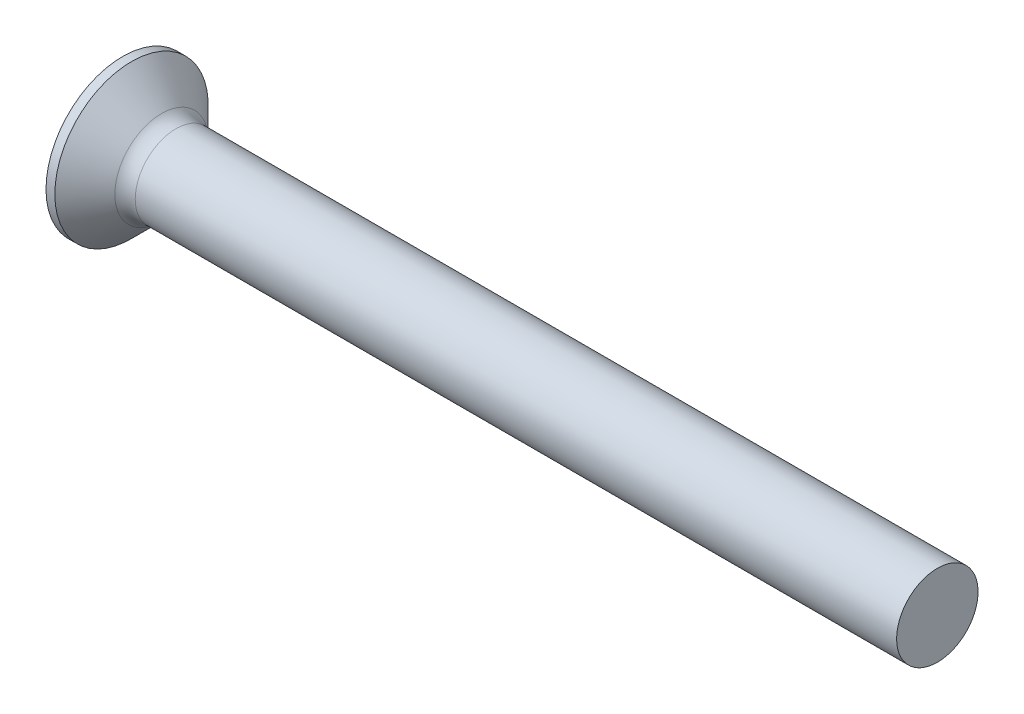
ISO-10303-21;
HEADER;
FILE_DESCRIPTION(('STEP AP214'),'2;1');
FILE_NAME('part.step','',(''),(''),'','','');
FILE_SCHEMA(('AUTOMOTIVE_DESIGN { 1 0 10303 214 1 1 1 1 }'));
ENDSEC;
DATA;
#1=APPLICATION_CONTEXT('core data for automotive mechanical design processes');
#2=APPLICATION_PROTOCOL_DEFINITION('international standard','automotive_design',2000,#1);
#3=PRODUCT_CONTEXT('',#1,'mechanical');
#4=PRODUCT('Part','Part','',(#3));
#5=PRODUCT_RELATED_PRODUCT_CATEGORY('part','',(#4));
#6=PRODUCT_DEFINITION_FORMATION('','',#4);
#7=PRODUCT_DEFINITION_CONTEXT('part definition',#1,'design');
#8=PRODUCT_DEFINITION('design','',#6,#7);
#9=PRODUCT_DEFINITION_SHAPE('','',#8);
#10=(LENGTH_UNIT() NAMED_UNIT(*) SI_UNIT(.MILLI.,.METRE.));
#11=(NAMED_UNIT(*) PLANE_ANGLE_UNIT() SI_UNIT($,.RADIAN.));
#12=(NAMED_UNIT(*) SI_UNIT($,.STERADIAN.) SOLID_ANGLE_UNIT());
#13=UNCERTAINTY_MEASURE_WITH_UNIT(LENGTH_MEASURE(1.E-05),#10,'distance_accuracy_value','');
#14=(GEOMETRIC_REPRESENTATION_CONTEXT(3) GLOBAL_UNCERTAINTY_ASSIGNED_CONTEXT((#13)) GLOBAL_UNIT_ASSIGNED_CONTEXT((#10,
#11,#12)) REPRESENTATION_CONTEXT('',''));
#15=CARTESIAN_POINT('',(0.,0.,0.));
#16=DIRECTION('',(0.,0.,1.));
#17=DIRECTION('',(1.,0.,0.));
#18=AXIS2_PLACEMENT_3D('',#15,#16,#17);
#19=CARTESIAN_POINT('',(12.1008928571429,0.,0.));
#20=DIRECTION('',(-1.,0.,0.));
#21=DIRECTION('',(0.,-1.,0.));
#22=AXIS2_PLACEMENT_3D('',#19,#20,#21);
#23=SPHERICAL_SURFACE('',#22,12.1008928571429);
#24=CARTESIAN_POINT('',(1.4,0.,0.));
#25=DIRECTION('',(-1.,0.,0.));
#26=DIRECTION('',(0.,0.,1.));
#27=AXIS2_PLACEMENT_3D('',#24,#25,#26);
#28=CIRCLE('',#27,5.65);
#29=CARTESIAN_POINT('',(1.4,0.,5.65));
#30=VERTEX_POINT('',#29);
#31=EDGE_CURVE('E204',#30,#30,#28,.T.);
#32=ORIENTED_EDGE('',*,*,#31,.T.);
#33=EDGE_LOOP('',(#32));
#34=FACE_BOUND('',#33,.T.);
#35=CARTESIAN_POINT('',(12.1008928571429,0.71,0.));
#36=DIRECTION('',(0.,-1.,0.));
#37=DIRECTION('',(0.,0.,-1.));
#38=AXIS2_PLACEMENT_3D('',#35,#36,#37);
#39=CIRCLE('',#38,12.0800458583588);
#40=CARTESIAN_POINT('',(0.482948472413199,0.710000000000012,-3.30921081428481));
#41=VERTEX_POINT('',#40);
#42=CARTESIAN_POINT('',(0.0987540062714724,0.710000000000005,-1.36973389549017));
#43=VERTEX_POINT('',#42);
#44=EDGE_CURVE('E284',#41,#43,#39,.F.);
#45=ORIENTED_EDGE('',*,*,#44,.T.);
#46=CARTESIAN_POINT('',(0.098754006271469,0.,0.));
#47=DIRECTION('',(1.,0.,0.));
#48=DIRECTION('',(0.,0.,-1.));
#49=AXIS2_PLACEMENT_3D('',#46,#47,#48);
#50=CIRCLE('',#49,1.54281267315727);
#51=CARTESIAN_POINT('',(0.098754006271469,1.36973389549016,-0.71));
#52=VERTEX_POINT('',#51);
#53=EDGE_CURVE('E313',#43,#52,#50,.T.);
#54=ORIENTED_EDGE('',*,*,#53,.T.);
#55=CARTESIAN_POINT('',(12.1008928571429,0.,-0.71));
#56=DIRECTION('',(0.,0.,1.));
#57=DIRECTION('',(1.,0.,0.));
#58=AXIS2_PLACEMENT_3D('',#55,#56,#57);
#59=CIRCLE('',#58,12.0800458583588);
#60=CARTESIAN_POINT('',(0.482948472413196,3.30921081428482,-0.71));
#61=VERTEX_POINT('',#60);
#62=EDGE_CURVE('E226',#52,#61,#59,.F.);
#63=ORIENTED_EDGE('',*,*,#62,.T.);
#64=CARTESIAN_POINT('',(11.1092745190887,-1.98887902775924,0.));
#65=DIRECTION('',(0.446197753347436,0.894934391398443,0.));
#66=DIRECTION('',(-0.894934391398443,0.446197753347436,0.));
#67=AXIS2_PLACEMENT_3D('',#64,#65,#66);
#68=CIRCLE('',#67,11.8950687776332);
#69=CARTESIAN_POINT('',(0.482948472413196,3.30921081428482,0.710000000000001));
#70=VERTEX_POINT('',#69);
#71=EDGE_CURVE('E230',#70,#61,#68,.F.);
#72=ORIENTED_EDGE('',*,*,#71,.F.);
#73=CARTESIAN_POINT('',(12.1008928571429,0.,0.71));
#74=DIRECTION('',(0.,0.,-1.));
#75=DIRECTION('',(0.,1.,0.));
#76=AXIS2_PLACEMENT_3D('',#73,#74,#75);
#77=CIRCLE('',#76,12.0800458583588);
#78=CARTESIAN_POINT('',(0.098754006271469,1.36973389549016,0.71));
#79=VERTEX_POINT('',#78);
#80=EDGE_CURVE('E223',#70,#79,#77,.F.);
#81=ORIENTED_EDGE('',*,*,#80,.T.);
#82=CARTESIAN_POINT('',(0.0987540062714738,0.709999999999995,1.36973389549018));
#83=VERTEX_POINT('',#82);
#84=EDGE_CURVE('E339',#79,#83,#50,.T.);
#85=ORIENTED_EDGE('',*,*,#84,.T.);
#86=CARTESIAN_POINT('',(0.482948472413196,0.709999999999988,3.30921081428482));
#87=VERTEX_POINT('',#86);
#88=EDGE_CURVE('E251',#83,#87,#39,.F.);
#89=ORIENTED_EDGE('',*,*,#88,.T.);
#90=CARTESIAN_POINT('',(11.1092745190887,0.,-1.98887902775924));
#91=DIRECTION('',(0.446197753347436,0.,0.894934391398443));
#92=DIRECTION('',(0.894934391398443,0.,-0.446197753347436));
#93=AXIS2_PLACEMENT_3D('',#90,#91,#92);
#94=CIRCLE('',#93,11.8950687776332);
#95=CARTESIAN_POINT('',(0.482948472413196,-0.710000000000012,3.30921081428481));
#96=VERTEX_POINT('',#95);
#97=EDGE_CURVE('E48',#96,#87,#94,.F.);
#98=ORIENTED_EDGE('',*,*,#97,.F.);
#99=CARTESIAN_POINT('',(12.1008928571429,-0.71,0.));
#100=DIRECTION('',(0.,1.,0.));
#101=DIRECTION('',(0.,0.,1.));
#102=AXIS2_PLACEMENT_3D('',#99,#100,#101);
#103=CIRCLE('',#102,12.0800458583588);
#104=CARTESIAN_POINT('',(0.0987540062714724,-0.710000000000005,1.36973389549017));
#105=VERTEX_POINT('',#104);
#106=EDGE_CURVE('E254',#96,#105,#103,.F.);
#107=ORIENTED_EDGE('',*,*,#106,.T.);
#108=CARTESIAN_POINT('',(0.098754006271469,-1.36973389549016,0.71));
#109=VERTEX_POINT('',#108);
#110=EDGE_CURVE('E370',#105,#109,#50,.T.);
#111=ORIENTED_EDGE('',*,*,#110,.T.);
#112=CARTESIAN_POINT('',(0.482948472413197,-3.30921081428481,0.71));
#113=VERTEX_POINT('',#112);
#114=EDGE_CURVE('E222',#109,#113,#77,.F.);
#115=ORIENTED_EDGE('',*,*,#114,.T.);
#116=CARTESIAN_POINT('',(11.1092745190887,1.98887902775924,0.));
#117=DIRECTION('',(0.446197753347436,-0.894934391398443,0.));
#118=DIRECTION('',(0.894934391398443,0.446197753347436,0.));
#119=AXIS2_PLACEMENT_3D('',#116,#117,#118);
#120=CIRCLE('',#119,11.8950687776332);
#121=CARTESIAN_POINT('',(0.482948472413197,-3.30921081428481,-0.71));
#122=VERTEX_POINT('',#121);
#123=EDGE_CURVE('E220',#122,#113,#120,.F.);
#124=ORIENTED_EDGE('',*,*,#123,.F.);
#125=CARTESIAN_POINT('',(0.098754006271469,-1.36973389549016,-0.71));
#126=VERTEX_POINT('',#125);
#127=EDGE_CURVE('E227',#122,#126,#59,.F.);
#128=ORIENTED_EDGE('',*,*,#127,.T.);
#129=CARTESIAN_POINT('',(0.0987540062714729,-0.709999999999995,-1.36973389549018));
#130=VERTEX_POINT('',#129);
#131=EDGE_CURVE('E334',#126,#130,#50,.T.);
#132=ORIENTED_EDGE('',*,*,#131,.T.);
#133=CARTESIAN_POINT('',(0.482948472413199,-0.709999999999988,-3.30921081428482));
#134=VERTEX_POINT('',#133);
#135=EDGE_CURVE('E256',#130,#134,#103,.F.);
#136=ORIENTED_EDGE('',*,*,#135,.T.);
#137=CARTESIAN_POINT('',(11.1092745190887,0.,1.98887902775924));
#138=DIRECTION('',(0.446197753347436,0.,-0.894934391398443));
#139=DIRECTION('',(-0.894934391398443,0.,-0.446197753347436));
#140=AXIS2_PLACEMENT_3D('',#137,#138,#139);
#141=CIRCLE('',#140,11.8950687776332);
#142=EDGE_CURVE('E233',#41,#134,#141,.F.);
#143=ORIENTED_EDGE('',*,*,#142,.F.);
#144=EDGE_LOOP('',(#45,#54,#63,#72,#81,#85,#89,#98,#107,#111,#115,#124,#128,#132,#136,#143));
#145=FACE_BOUND('',#144,.T.);
#146=ADVANCED_FACE('F35',(#34,#145),#23,.T.);
#147=CARTESIAN_POINT('',(3.85,1.63046113000165,-0.71));
#148=DIRECTION('',(0.,0.,1.));
#149=DIRECTION('',(1.,0.,0.));
#150=AXIS2_PLACEMENT_3D('',#147,#148,#149);
#151=PLANE('',#150);
#152=ORIENTED_EDGE('',*,*,#62,.F.);
#153=CARTESIAN_POINT('',(-2.28416404218902,1.55502211619796,-0.71));
#154=CARTESIAN_POINT('',(-1.81431723075455,1.5188973409894,-0.71));
#155=CARTESIAN_POINT('',(-1.34448576560339,1.48257035219444,-0.71));
#156=CARTESIAN_POINT('',(-0.404856630505598,1.40937585920065,-0.71));
#157=CARTESIAN_POINT('',(0.0649410386989113,1.37250834548094,-0.71));
#158=CARTESIAN_POINT('',(0.769597582006443,1.31670055934447,-0.71));
#159=CARTESIAN_POINT('',(1.00447650753016,1.29801353896655,-0.71));
#160=CARTESIAN_POINT('',(1.47421830081038,1.26044599841081,-0.71));
#161=CARTESIAN_POINT('',(1.70908116860549,1.24156547871592,-0.71));
#162=CARTESIAN_POINT('',(2.17878500370985,1.20358363137223,-0.71));
#163=CARTESIAN_POINT('',(2.41362597132576,1.18448230751803,-0.71));
#164=CARTESIAN_POINT('',(2.88328904378171,1.14602401545414,-0.71));
#165=CARTESIAN_POINT('',(3.11811114843923,1.12666704501482,-0.71));
#166=CARTESIAN_POINT('',(3.65621662823936,1.08196691887825,-0.71));
#167=CARTESIAN_POINT('',(3.95949176983097,1.05652447286241,-0.71));
#168=CARTESIAN_POINT('',(4.56598922959562,1.0050269975527,-0.71));
#169=CARTESIAN_POINT('',(4.86921154792195,0.978971970067306,-0.71));
#170=CARTESIAN_POINT('',(5.47557652075129,0.926088010649148,-0.71));
#171=CARTESIAN_POINT('',(5.77871917797252,0.899259109950115,-0.71));
#172=CARTESIAN_POINT('',(6.38491792808092,0.844594572548036,-0.71));
#173=CARTESIAN_POINT('',(6.68797401983324,0.816758923206859,-0.71));
#174=CARTESIAN_POINT('',(7.29401284533129,0.759724083482611,-0.71));
#175=CARTESIAN_POINT('',(7.59699555631377,0.730524650498859,-0.71));
#176=CARTESIAN_POINT('',(8.20276249162816,0.670213734528277,-0.71));
#177=CARTESIAN_POINT('',(8.50554672245943,0.639102317673413,-0.71));
#178=CARTESIAN_POINT('',(8.95951323858269,0.590224303525513,-0.71));
#179=CARTESIAN_POINT('',(9.11081400259868,0.573561556658641,-0.71));
#180=CARTESIAN_POINT('',(9.41330341679391,0.539268690497853,-0.71));
#181=CARTESIAN_POINT('',(9.5644920688636,0.521638587909618,-0.71));
#182=CARTESIAN_POINT('',(9.86673681243328,0.485109134793815,-0.71));
#183=CARTESIAN_POINT('',(10.017792885913,0.466209632690505,-0.71));
#184=CARTESIAN_POINT('',(10.3196626901993,0.426508363296112,-0.71));
#185=CARTESIAN_POINT('',(10.4704764059468,0.405706482121441,-0.71));
#186=CARTESIAN_POINT('',(10.6211140501562,0.383637037200752,-0.71));
#187=B_SPLINE_CURVE_WITH_KNOTS('',3,(#153,#154,#155,#156,#157,#158,#159,#160,#161,#162,#163,
#164,#165,#166,#167,#168,#169,#170,#171,#172,#173,#174,#175,#176,#177,#178,#179,#180,#181,#182,
#183,#184,#185,#186),.UNSPECIFIED.,.F.,.F.,(4,2,2,2,2,2,2,2,2,2,2,2,2,2,2,2,4),(0.,
1.41370082264972,2.82742657641579,3.53428988171118,4.24115142325821,4.94800083512325,
5.6548564158573,6.56787736296362,7.480895614993,8.39387706878533,9.30686998759161,
10.2200259400543,11.1331503259072,11.5897944565879,12.0464307037662,12.5031215739793,
12.9598398013493),.UNSPECIFIED.);
#188=CARTESIAN_POINT('',(3.85,1.06563607765503,-0.71));
#189=VERTEX_POINT('',#188);
#190=EDGE_CURVE('E359',#52,#189,#187,.T.);
#191=ORIENTED_EDGE('',*,*,#190,.T.);
#192=DIRECTION('',(0.,1.,0.));
#193=VECTOR('',#192,1.);
#194=CARTESIAN_POINT('',(3.85,-1.63046113000165,-0.71));
#195=LINE('',#194,#193);
#196=CARTESIAN_POINT('',(3.85,1.63046113000165,-0.71));
#197=VERTEX_POINT('',#196);
#198=EDGE_CURVE('E304',#189,#197,#195,.T.);
#199=ORIENTED_EDGE('',*,*,#198,.T.);
#200=DIRECTION('',(0.894934391398443,-0.446197753347436,0.));
#201=VECTOR('',#200,1.);
#202=CARTESIAN_POINT('',(0.,3.55,-0.71));
#203=LINE('',#202,#201);
#204=EDGE_CURVE('E201',#61,#197,#203,.T.);
#205=ORIENTED_EDGE('',*,*,#204,.F.);
#206=EDGE_LOOP('',(#152,#191,#199,#205));
#207=FACE_BOUND('',#206,.T.);
#208=ADVANCED_FACE('F169',(#207),#151,.T.);
#209=CARTESIAN_POINT('',(3.85,-1.63046113000165,-0.71));
#210=VERTEX_POINT('',#209);
#211=CARTESIAN_POINT('',(3.85,-1.06563607765503,-0.71));
#212=VERTEX_POINT('',#211);
#213=EDGE_CURVE('E210',#210,#212,#195,.T.);
#214=ORIENTED_EDGE('',*,*,#213,.T.);
#215=CARTESIAN_POINT('',(-2.28416404218902,-1.55502211619796,-0.71));
#216=CARTESIAN_POINT('',(-1.81431723075455,-1.5188973409894,-0.71));
#217=CARTESIAN_POINT('',(-1.34448576560339,-1.48257035219444,-0.71));
#218=CARTESIAN_POINT('',(-0.404856630505598,-1.40937585920065,-0.71));
#219=CARTESIAN_POINT('',(0.0649410386989112,-1.37250834548094,-0.71));
#220=CARTESIAN_POINT('',(0.769597582006443,-1.31670055934447,-0.71));
#221=CARTESIAN_POINT('',(1.00447650753016,-1.29801353896655,-0.71));
#222=CARTESIAN_POINT('',(1.47421830081038,-1.26044599841081,-0.71));
#223=CARTESIAN_POINT('',(1.70908116860549,-1.24156547871592,-0.71));
#224=CARTESIAN_POINT('',(2.17878500370985,-1.20358363137223,-0.71));
#225=CARTESIAN_POINT('',(2.41362597132576,-1.18448230751803,-0.71));
#226=CARTESIAN_POINT('',(2.88328904378171,-1.14602401545414,-0.71));
#227=CARTESIAN_POINT('',(3.11811114843923,-1.12666704501482,-0.71));
#228=CARTESIAN_POINT('',(3.65621662823936,-1.08196691887825,-0.71));
#229=CARTESIAN_POINT('',(3.95949176983097,-1.05652447286241,-0.71));
#230=CARTESIAN_POINT('',(4.56598922959562,-1.0050269975527,-0.71));
#231=CARTESIAN_POINT('',(4.86921154792195,-0.978971970067306,-0.71));
#232=CARTESIAN_POINT('',(5.47557652075129,-0.926088010649148,-0.71));
#233=CARTESIAN_POINT('',(5.77871917797252,-0.899259109950115,-0.71));
#234=CARTESIAN_POINT('',(6.38491792808092,-0.844594572548036,-0.71));
#235=CARTESIAN_POINT('',(6.68797401983324,-0.816758923206859,-0.71));
#236=CARTESIAN_POINT('',(7.2940128453313,-0.75972408348261,-0.71));
#237=CARTESIAN_POINT('',(7.59699555631378,-0.730524650498859,-0.71));
#238=CARTESIAN_POINT('',(8.20276249162817,-0.670213734528277,-0.71));
#239=CARTESIAN_POINT('',(8.50554672245944,-0.639102317673412,-0.71));
#240=CARTESIAN_POINT('',(8.9595132385827,-0.590224303525513,-0.71));
#241=CARTESIAN_POINT('',(9.11081400259869,-0.57356155665864,-0.71));
#242=CARTESIAN_POINT('',(9.41330341679392,-0.539268690497852,-0.71));
#243=CARTESIAN_POINT('',(9.5644920688636,-0.521638587909617,-0.71));
#244=CARTESIAN_POINT('',(9.86673681243329,-0.485109134793814,-0.71));
#245=CARTESIAN_POINT('',(10.017792885913,-0.466209632690504,-0.71));
#246=CARTESIAN_POINT('',(10.3196626901993,-0.426508363296111,-0.71));
#247=CARTESIAN_POINT('',(10.4704764059468,-0.40570648212144,-0.71));
#248=CARTESIAN_POINT('',(10.6211140501562,-0.383637037200751,-0.71));
#249=B_SPLINE_CURVE_WITH_KNOTS('',3,(#215,#216,#217,#218,#219,#220,#221,#222,#223,#224,#225,
#226,#227,#228,#229,#230,#231,#232,#233,#234,#235,#236,#237,#238,#239,#240,#241,#242,#243,#244,
#245,#246,#247,#248),.UNSPECIFIED.,.F.,.F.,(4,2,2,2,2,2,2,2,2,2,2,2,2,2,2,2,4),(0.,
1.41370082264972,2.82742657641579,3.53428988171118,4.24115142325821,4.94800083512325,
5.6548564158573,6.56787736296362,7.480895614993,8.39387706878533,9.30686998759161,
10.2200259400543,11.1331503259072,11.5897944565879,12.0464307037663,12.5031215739793,
12.9598398013493),.UNSPECIFIED.);
#250=EDGE_CURVE('E338',#212,#126,#249,.F.);
#251=ORIENTED_EDGE('',*,*,#250,.T.);
#252=ORIENTED_EDGE('',*,*,#127,.F.);
#253=DIRECTION('',(0.894934391398443,0.446197753347436,0.));
#254=VECTOR('',#253,1.);
#255=CARTESIAN_POINT('',(0.,-3.55,-0.71));
#256=LINE('',#255,#254);
#257=EDGE_CURVE('E63',#122,#210,#256,.T.);
#258=ORIENTED_EDGE('',*,*,#257,.T.);
#259=EDGE_LOOP('',(#214,#251,#252,#258));
#260=FACE_BOUND('',#259,.T.);
#261=ADVANCED_FACE('F175',(#260),#151,.T.);
#262=CARTESIAN_POINT('',(3.85,-1.63046113000165,0.71));
#263=DIRECTION('',(0.,0.,-1.));
#264=DIRECTION('',(0.,1.,0.));
#265=AXIS2_PLACEMENT_3D('',#262,#263,#264);
#266=PLANE('',#265);
#267=DIRECTION('',(0.,-1.,0.));
#268=VECTOR('',#267,1.);
#269=CARTESIAN_POINT('',(3.85,1.63046113000165,0.71));
#270=LINE('',#269,#268);
#271=CARTESIAN_POINT('',(3.85,1.63046113000165,0.71));
#272=VERTEX_POINT('',#271);
#273=CARTESIAN_POINT('',(3.85,1.06563607765503,0.71));
#274=VERTEX_POINT('',#273);
#275=EDGE_CURVE('E294',#272,#274,#270,.T.);
#276=ORIENTED_EDGE('',*,*,#275,.T.);
#277=CARTESIAN_POINT('',(-2.28416405272969,1.55502211700823,0.71));
#278=CARTESIAN_POINT('',(-1.81431723993559,1.51889734169832,0.71));
#279=CARTESIAN_POINT('',(-1.34448577342483,1.48257035280125,0.71));
#280=CARTESIAN_POINT('',(-0.404856635607935,1.40937585960063,0.71));
#281=CARTESIAN_POINT('',(0.0649410349561023,1.3725083457762,0.71));
#282=CARTESIAN_POINT('',(0.769597580720013,1.31670055944693,0.71));
#283=CARTESIAN_POINT('',(1.00447650734066,1.29801353898196,0.71));
#284=CARTESIAN_POINT('',(1.47421830281459,1.26044599825028,0.71));
#285=CARTESIAN_POINT('',(1.70908117170647,1.2415654784665,0.71));
#286=CARTESIAN_POINT('',(2.17878500900413,1.20358363094279,0.71));
#287=CARTESIAN_POINT('',(2.41362597771655,1.18448230699746,0.71));
#288=CARTESIAN_POINT('',(2.88328905236533,1.14602401474853,0.71));
#289=CARTESIAN_POINT('',(3.11811115811918,1.1266670442153,0.71));
#290=CARTESIAN_POINT('',(3.65621663901539,1.08196691797715,0.71));
#291=CARTESIAN_POINT('',(3.95949178060685,1.05652447195478,0.71));
#292=CARTESIAN_POINT('',(4.56598924037105,1.00502699663041,0.71));
#293=CARTESIAN_POINT('',(4.86921155869707,0.978971969136867,0.71));
#294=CARTESIAN_POINT('',(5.47557653152543,0.926088009700163,0.71));
#295=CARTESIAN_POINT('',(5.77871918874598,0.899259108990728,0.71));
#296=CARTESIAN_POINT('',(6.38491793885273,0.844594571564524,0.71));
#297=CARTESIAN_POINT('',(6.68797403060408,0.816758922209623,0.71));
#298=CARTESIAN_POINT('',(7.29401285610024,0.759724082452705,0.71));
#299=CARTESIAN_POINT('',(7.59699556708178,0.730524649450005,0.71));
#300=CARTESIAN_POINT('',(8.20276250239317,0.670213733433009,0.71));
#301=CARTESIAN_POINT('',(8.50554673322238,0.639102316550682,0.71));
#302=CARTESIAN_POINT('',(8.95951324934133,0.590224302349253,0.71));
#303=CARTESIAN_POINT('',(9.11081401335585,0.573561555462458,0.71));
#304=CARTESIAN_POINT('',(9.41330342754723,0.539268689255513,0.71));
#305=CARTESIAN_POINT('',(9.56449207961453,0.521638586641043,0.71));
#306=CARTESIAN_POINT('',(9.86673682317841,0.485109133463432,0.71));
#307=CARTESIAN_POINT('',(10.0177928966547,0.466209631324544,0.71));
#308=CARTESIAN_POINT('',(10.3196627009313,0.426508361840778,0.71));
#309=CARTESIAN_POINT('',(10.4704764166726,0.405706480612307,0.71));
#310=CARTESIAN_POINT('',(10.6211140608734,0.383637035624275,0.71));
#311=B_SPLINE_CURVE_WITH_KNOTS('',3,(#277,#278,#279,#280,#281,#282,#283,#284,#285,#286,#287,
#288,#289,#290,#291,#292,#293,#294,#295,#296,#297,#298,#299,#300,#301,#302,#303,#304,#305,#306,
#307,#308,#309,#310),.UNSPECIFIED.,.F.,.F.,(4,2,2,2,2,2,2,2,2,2,2,2,2,2,2,2,4),(0.,
1.41370082673995,2.82742658459668,3.53428989319321,4.24115143804135,4.94800085320726,
5.6548564372423,6.56787738434983,7.48089563638038,8.39387709017341,9.30687000898056,
10.2200259614459,11.1331503473009,11.5897944779837,12.0464307251641,12.50312159538,
12.9598398227534),.UNSPECIFIED.);
#312=EDGE_CURVE('E261',#274,#79,#311,.F.);
#313=ORIENTED_EDGE('',*,*,#312,.T.);
#314=ORIENTED_EDGE('',*,*,#80,.F.);
#315=DIRECTION('',(0.894934391398443,-0.446197753347436,0.));
#316=VECTOR('',#315,1.);
#317=CARTESIAN_POINT('',(0.,3.55,0.71));
#318=LINE('',#317,#316);
#319=EDGE_CURVE('E207',#70,#272,#318,.T.);
#320=ORIENTED_EDGE('',*,*,#319,.T.);
#321=EDGE_LOOP('',(#276,#313,#314,#320));
#322=FACE_BOUND('',#321,.T.);
#323=ADVANCED_FACE('F355',(#322),#266,.T.);
#324=ORIENTED_EDGE('',*,*,#114,.F.);
#325=CARTESIAN_POINT('',(-2.28416404218902,-1.55502211619796,0.71));
#326=CARTESIAN_POINT('',(-1.81431723075455,-1.5188973409894,0.71));
#327=CARTESIAN_POINT('',(-1.34448576560339,-1.48257035219444,0.71));
#328=CARTESIAN_POINT('',(-0.404856630505598,-1.40937585920065,0.71));
#329=CARTESIAN_POINT('',(0.0649410386989115,-1.37250834548094,0.71));
#330=CARTESIAN_POINT('',(0.769597582006443,-1.31670055934447,0.71));
#331=CARTESIAN_POINT('',(1.00447650753016,-1.29801353896655,0.71));
#332=CARTESIAN_POINT('',(1.47421830081038,-1.26044599841081,0.71));
#333=CARTESIAN_POINT('',(1.70908116860549,-1.24156547871592,0.71));
#334=CARTESIAN_POINT('',(2.17878500370985,-1.20358363137223,0.71));
#335=CARTESIAN_POINT('',(2.41362597132576,-1.18448230751803,0.71));
#336=CARTESIAN_POINT('',(2.88328904378171,-1.14602401545414,0.71));
#337=CARTESIAN_POINT('',(3.11811114843923,-1.12666704501482,0.71));
#338=CARTESIAN_POINT('',(3.65621662823936,-1.08196691887825,0.71));
#339=CARTESIAN_POINT('',(3.95949176983097,-1.05652447286241,0.71));
#340=CARTESIAN_POINT('',(4.56598922959561,-1.0050269975527,0.71));
#341=CARTESIAN_POINT('',(4.86921154792194,-0.978971970067306,0.71));
#342=CARTESIAN_POINT('',(5.47557652075129,-0.926088010649148,0.71));
#343=CARTESIAN_POINT('',(5.77871917797252,-0.899259109950115,0.71));
#344=CARTESIAN_POINT('',(6.38491792808092,-0.844594572548036,0.71));
#345=CARTESIAN_POINT('',(6.68797401983323,-0.81675892320686,0.71));
#346=CARTESIAN_POINT('',(7.29401284533129,-0.759724083482611,0.71));
#347=CARTESIAN_POINT('',(7.59699555631377,-0.73052465049886,0.71));
#348=CARTESIAN_POINT('',(8.20276249162816,-0.670213734528277,0.71));
#349=CARTESIAN_POINT('',(8.50554672245943,-0.639102317673413,0.71));
#350=CARTESIAN_POINT('',(8.95951323858269,-0.590224303525514,0.71));
#351=CARTESIAN_POINT('',(9.11081400259867,-0.573561556658641,0.71));
#352=CARTESIAN_POINT('',(9.41330341679391,-0.539268690497853,0.71));
#353=CARTESIAN_POINT('',(9.56449206886359,-0.521638587909618,0.71));
#354=CARTESIAN_POINT('',(9.86673681243328,-0.485109134793815,0.71));
#355=CARTESIAN_POINT('',(10.017792885913,-0.466209632690505,0.71));
#356=CARTESIAN_POINT('',(10.3196626901993,-0.426508363296112,0.71));
#357=CARTESIAN_POINT('',(10.4704764059468,-0.40570648212144,0.71));
#358=CARTESIAN_POINT('',(10.6211140501562,-0.383637037200752,0.71));
#359=B_SPLINE_CURVE_WITH_KNOTS('',3,(#325,#326,#327,#328,#329,#330,#331,#332,#333,#334,#335,
#336,#337,#338,#339,#340,#341,#342,#343,#344,#345,#346,#347,#348,#349,#350,#351,#352,#353,#354,
#355,#356,#357,#358),.UNSPECIFIED.,.F.,.F.,(4,2,2,2,2,2,2,2,2,2,2,2,2,2,2,2,4),(0.,
1.41370082264972,2.82742657641579,3.53428988171118,4.24115142325821,4.94800083512325,
5.6548564158573,6.56787736296362,7.480895614993,8.39387706878533,9.3068699875916,
10.2200259400543,11.1331503259072,11.5897944565878,12.0464307037662,12.5031215739793,
12.9598398013493),.UNSPECIFIED.);
#360=CARTESIAN_POINT('',(3.85,-1.06563607765503,0.71));
#361=VERTEX_POINT('',#360);
#362=EDGE_CURVE('E371',#109,#361,#359,.T.);
#363=ORIENTED_EDGE('',*,*,#362,.T.);
#364=CARTESIAN_POINT('',(3.85,-1.63046113000165,0.71));
#365=VERTEX_POINT('',#364);
#366=EDGE_CURVE('E296',#361,#365,#270,.T.);
#367=ORIENTED_EDGE('',*,*,#366,.T.);
#368=DIRECTION('',(0.894934391398443,0.446197753347436,0.));
#369=VECTOR('',#368,1.);
#370=CARTESIAN_POINT('',(0.,-3.55,0.709999999999999));
#371=LINE('',#370,#369);
#372=EDGE_CURVE('E288',#113,#365,#371,.T.);
#373=ORIENTED_EDGE('',*,*,#372,.F.);
#374=EDGE_LOOP('',(#324,#363,#367,#373));
#375=FACE_BOUND('',#374,.T.);
#376=ADVANCED_FACE('F473',(#375),#266,.T.);
#377=CARTESIAN_POINT('',(3.85,1.63046113000165,-0.709999999999999));
#378=DIRECTION('',(-1.,0.,0.));
#379=DIRECTION('',(0.,0.,1.));
#380=AXIS2_PLACEMENT_3D('',#377,#378,#379);
#381=PLANE('',#380);
#382=ORIENTED_EDGE('',*,*,#366,.F.);
#383=CARTESIAN_POINT('',(3.85,0.,0.));
#384=DIRECTION('',(-1.,0.,0.));
#385=DIRECTION('',(0.,0.,1.));
#386=AXIS2_PLACEMENT_3D('',#383,#384,#385);
#387=CIRCLE('',#386,1.2805);
#388=EDGE_CURVE('E331',#212,#361,#387,.T.);
#389=ORIENTED_EDGE('',*,*,#388,.F.);
#390=ORIENTED_EDGE('',*,*,#213,.F.);
#391=DIRECTION('',(0.,0.,1.));
#392=VECTOR('',#391,1.);
#393=CARTESIAN_POINT('',(3.85,-1.63046113000165,-0.71));
#394=LINE('',#393,#392);
#395=EDGE_CURVE('E291',#210,#365,#394,.T.);
#396=ORIENTED_EDGE('',*,*,#395,.T.);
#397=EDGE_LOOP('',(#382,#389,#390,#396));
#398=FACE_BOUND('',#397,.T.);
#399=ADVANCED_FACE('F400',(#398),#381,.T.);
#400=DIRECTION('',(0.,0.,-1.));
#401=VECTOR('',#400,1.);
#402=CARTESIAN_POINT('',(3.85,-0.710000000000006,1.63046113000165));
#403=LINE('',#402,#401);
#404=CARTESIAN_POINT('',(3.85,-0.709999999999996,-1.06563607765503));
#405=VERTEX_POINT('',#404);
#406=CARTESIAN_POINT('',(3.85,-0.709999999999994,-1.63046113000165));
#407=VERTEX_POINT('',#406);
#408=EDGE_CURVE('E278',#405,#407,#403,.T.);
#409=ORIENTED_EDGE('',*,*,#408,.F.);
#410=CARTESIAN_POINT('',(3.85,0.710000000000004,-1.06563607765503));
#411=VERTEX_POINT('',#410);
#412=EDGE_CURVE('E55',#411,#405,#387,.T.);
#413=ORIENTED_EDGE('',*,*,#412,.F.);
#414=DIRECTION('',(0.,0.,1.));
#415=VECTOR('',#414,1.);
#416=CARTESIAN_POINT('',(3.85,0.710000000000006,-1.63046113000165));
#417=LINE('',#416,#415);
#418=CARTESIAN_POINT('',(3.85,0.710000000000006,-1.63046113000165));
#419=VERTEX_POINT('',#418);
#420=EDGE_CURVE('E281',#419,#411,#417,.T.);
#421=ORIENTED_EDGE('',*,*,#420,.F.);
#422=DIRECTION('',(0.,-1.,0.));
#423=VECTOR('',#422,1.);
#424=CARTESIAN_POINT('',(3.85,0.710000000000006,-1.63046113000165));
#425=LINE('',#424,#423);
#426=EDGE_CURVE('E272',#419,#407,#425,.T.);
#427=ORIENTED_EDGE('',*,*,#426,.T.);
#428=EDGE_LOOP('',(#409,#413,#421,#427));
#429=FACE_BOUND('',#428,.T.);
#430=ADVANCED_FACE('F326',(#429),#381,.T.);
#431=ORIENTED_EDGE('',*,*,#198,.F.);
#432=EDGE_CURVE('E330',#274,#189,#387,.T.);
#433=ORIENTED_EDGE('',*,*,#432,.F.);
#434=ORIENTED_EDGE('',*,*,#275,.F.);
#435=DIRECTION('',(0.,0.,-1.));
#436=VECTOR('',#435,1.);
#437=CARTESIAN_POINT('',(3.85,1.63046113000165,0.71));
#438=LINE('',#437,#436);
#439=EDGE_CURVE('E297',#272,#197,#438,.T.);
#440=ORIENTED_EDGE('',*,*,#439,.T.);
#441=EDGE_LOOP('',(#431,#433,#434,#440));
#442=FACE_BOUND('',#441,.T.);
#443=ADVANCED_FACE('F401',(#442),#381,.T.);
#444=CARTESIAN_POINT('',(3.85,0.709999999999994,1.63046113000165));
#445=DIRECTION('',(0.,-1.,0.));
#446=DIRECTION('',(1.,0.,0.));
#447=AXIS2_PLACEMENT_3D('',#444,#445,#446);
#448=PLANE('',#447);
#449=ORIENTED_EDGE('',*,*,#88,.F.);
#450=CARTESIAN_POINT('',(-2.28416405272969,0.709999999999994,1.55502211700823));
#451=CARTESIAN_POINT('',(-1.81431723993558,0.709999999999995,1.51889734169833));
#452=CARTESIAN_POINT('',(-1.34448577342483,0.709999999999995,1.48257035280125));
#453=CARTESIAN_POINT('',(-0.404856635607935,0.709999999999995,1.40937585960063));
#454=CARTESIAN_POINT('',(0.0649410349561026,0.709999999999995,1.3725083457762));
#455=CARTESIAN_POINT('',(0.769597580720014,0.709999999999995,1.31670055944693));
#456=CARTESIAN_POINT('',(1.00447650734066,0.709999999999995,1.29801353898196));
#457=CARTESIAN_POINT('',(1.47421830281459,0.709999999999995,1.26044599825028));
#458=CARTESIAN_POINT('',(1.70908117170647,0.709999999999995,1.2415654784665));
#459=CARTESIAN_POINT('',(2.17878500900413,0.709999999999996,1.20358363094279));
#460=CARTESIAN_POINT('',(2.41362597771655,0.709999999999996,1.18448230699747));
#461=CARTESIAN_POINT('',(2.88328905236533,0.709999999999996,1.14602401474853));
#462=CARTESIAN_POINT('',(3.11811115811918,0.709999999999996,1.12666704421531));
#463=CARTESIAN_POINT('',(3.65621663901539,0.709999999999996,1.08196691797716));
#464=CARTESIAN_POINT('',(3.95949178060686,0.709999999999996,1.05652447195478));
#465=CARTESIAN_POINT('',(4.56598924037105,0.709999999999996,1.00502699663041));
#466=CARTESIAN_POINT('',(4.86921155869708,0.709999999999996,0.978971969136869));
#467=CARTESIAN_POINT('',(5.47557653152543,0.709999999999997,0.926088009700165));
#468=CARTESIAN_POINT('',(5.77871918874598,0.709999999999997,0.89925910899073));
#469=CARTESIAN_POINT('',(6.38491793885274,0.709999999999997,0.844594571564526));
#470=CARTESIAN_POINT('',(6.68797403060409,0.709999999999997,0.816758922209625));
#471=CARTESIAN_POINT('',(7.29401285610024,0.709999999999997,0.759724082452707));
#472=CARTESIAN_POINT('',(7.59699556708179,0.709999999999997,0.730524649450007));
#473=CARTESIAN_POINT('',(8.20276250239318,0.709999999999998,0.670213733433011));
#474=CARTESIAN_POINT('',(8.50554673322238,0.709999999999998,0.639102316550684));
#475=CARTESIAN_POINT('',(8.95951324934133,0.709999999999998,0.590224302349255));
#476=CARTESIAN_POINT('',(9.11081401335585,0.709999999999998,0.57356155546246));
#477=CARTESIAN_POINT('',(9.41330342754724,0.709999999999998,0.539268689255515));
#478=CARTESIAN_POINT('',(9.56449207961454,0.709999999999998,0.521638586641045));
#479=CARTESIAN_POINT('',(9.86673682317841,0.709999999999998,0.485109133463434));
#480=CARTESIAN_POINT('',(10.0177928966547,0.709999999999998,0.466209631324547));
#481=CARTESIAN_POINT('',(10.3196627009313,0.709999999999998,0.426508361840781));
#482=CARTESIAN_POINT('',(10.4704764166726,0.709999999999999,0.40570648061231));
#483=CARTESIAN_POINT('',(10.6211140608734,0.709999999999999,0.383637035624278));
#484=B_SPLINE_CURVE_WITH_KNOTS('',3,(#450,#451,#452,#453,#454,#455,#456,#457,#458,#459,#460,
#461,#462,#463,#464,#465,#466,#467,#468,#469,#470,#471,#472,#473,#474,#475,#476,#477,#478,#479,
#480,#481,#482,#483),.UNSPECIFIED.,.F.,.F.,(4,2,2,2,2,2,2,2,2,2,2,2,2,2,2,2,4),(0.,
1.41370082673995,2.82742658459668,3.53428989319321,4.24115143804135,4.94800085320726,
5.6548564372423,6.56787738434983,7.48089563638038,8.39387709017342,9.30687000898056,
10.2200259614459,11.1331503473009,11.5897944779837,12.0464307251641,12.50312159538,
12.9598398227534),.UNSPECIFIED.);
#485=CARTESIAN_POINT('',(3.85,0.709999999999996,1.06563607765503));
#486=VERTEX_POINT('',#485);
#487=EDGE_CURVE('E548',#83,#486,#484,.T.);
#488=ORIENTED_EDGE('',*,*,#487,.T.);
#489=CARTESIAN_POINT('',(3.85,0.709999999999994,1.63046113000165));
#490=VERTEX_POINT('',#489);
#491=EDGE_CURVE('E253',#486,#490,#417,.T.);
#492=ORIENTED_EDGE('',*,*,#491,.T.);
#493=DIRECTION('',(0.894934391398443,0.,-0.446197753347436));
#494=VECTOR('',#493,1.);
#495=CARTESIAN_POINT('',(0.,0.709999999999988,3.55));
#496=LINE('',#495,#494);
#497=EDGE_CURVE('E243',#87,#490,#496,.T.);
#498=ORIENTED_EDGE('',*,*,#497,.F.);
#499=EDGE_LOOP('',(#449,#488,#492,#498));
#500=FACE_BOUND('',#499,.T.);
#501=ADVANCED_FACE('F249',(#500),#448,.T.);
#502=CARTESIAN_POINT('',(3.85,-0.709999999999994,-1.63046113000165));
#503=DIRECTION('',(0.,1.,0.));
#504=DIRECTION('',(0.,0.,1.));
#505=AXIS2_PLACEMENT_3D('',#502,#503,#504);
#506=PLANE('',#505);
#507=CARTESIAN_POINT('',(3.85,-0.710000000000006,1.63046113000165));
#508=VERTEX_POINT('',#507);
#509=CARTESIAN_POINT('',(3.85,-0.710000000000004,1.06563607765503));
#510=VERTEX_POINT('',#509);
#511=EDGE_CURVE('E275',#508,#510,#403,.T.);
#512=ORIENTED_EDGE('',*,*,#511,.T.);
#513=CARTESIAN_POINT('',(-2.28416404218902,-0.710000000000005,1.55502211619796));
#514=CARTESIAN_POINT('',(-1.81431723075455,-0.710000000000005,1.51889734098939));
#515=CARTESIAN_POINT('',(-1.34448576560339,-0.710000000000005,1.48257035219444));
#516=CARTESIAN_POINT('',(-0.404856630505598,-0.710000000000005,1.40937585920065));
#517=CARTESIAN_POINT('',(0.0649410386989115,-0.710000000000005,1.37250834548093));
#518=CARTESIAN_POINT('',(0.769597582006443,-0.710000000000005,1.31670055934447));
#519=CARTESIAN_POINT('',(1.00447650753016,-0.710000000000004,1.29801353896655));
#520=CARTESIAN_POINT('',(1.47421830081038,-0.710000000000004,1.26044599841081));
#521=CARTESIAN_POINT('',(1.70908116860549,-0.710000000000004,1.24156547871592));
#522=CARTESIAN_POINT('',(2.17878500370985,-0.710000000000004,1.20358363137223));
#523=CARTESIAN_POINT('',(2.41362597132576,-0.710000000000004,1.18448230751803));
#524=CARTESIAN_POINT('',(2.88328904378171,-0.710000000000004,1.14602401545414));
#525=CARTESIAN_POINT('',(3.11811114843923,-0.710000000000004,1.12666704501482));
#526=CARTESIAN_POINT('',(3.65621662823936,-0.710000000000004,1.08196691887825));
#527=CARTESIAN_POINT('',(3.95949176983097,-0.710000000000004,1.05652447286241));
#528=CARTESIAN_POINT('',(4.56598922959562,-0.710000000000003,1.0050269975527));
#529=CARTESIAN_POINT('',(4.86921154792195,-0.710000000000003,0.978971970067303));
#530=CARTESIAN_POINT('',(5.4755765207513,-0.710000000000003,0.926088010649145));
#531=CARTESIAN_POINT('',(5.77871917797253,-0.710000000000003,0.899259109950112));
#532=CARTESIAN_POINT('',(6.38491792808093,-0.710000000000003,0.844594572548033));
#533=CARTESIAN_POINT('',(6.68797401983324,-0.710000000000003,0.816758923206857));
#534=CARTESIAN_POINT('',(7.2940128453313,-0.710000000000003,0.759724083482608));
#535=CARTESIAN_POINT('',(7.59699555631378,-0.710000000000003,0.730524650498857));
#536=CARTESIAN_POINT('',(8.20276249162817,-0.710000000000002,0.670213734528274));
#537=CARTESIAN_POINT('',(8.50554672245944,-0.710000000000002,0.639102317673409));
#538=CARTESIAN_POINT('',(8.95951323858269,-0.710000000000002,0.59022430352551));
#539=CARTESIAN_POINT('',(9.11081400259868,-0.710000000000002,0.573561556658638));
#540=CARTESIAN_POINT('',(9.41330341679391,-0.710000000000002,0.53926869049785));
#541=CARTESIAN_POINT('',(9.5644920688636,-0.710000000000002,0.521638587909615));
#542=CARTESIAN_POINT('',(9.86673681243328,-0.710000000000002,0.485109134793812));
#543=CARTESIAN_POINT('',(10.017792885913,-0.710000000000002,0.466209632690502));
#544=CARTESIAN_POINT('',(10.3196626901993,-0.710000000000002,0.426508363296109));
#545=CARTESIAN_POINT('',(10.4704764059468,-0.710000000000001,0.405706482121437));
#546=CARTESIAN_POINT('',(10.6211140501562,-0.710000000000001,0.383637037200749));
#547=B_SPLINE_CURVE_WITH_KNOTS('',3,(#513,#514,#515,#516,#517,#518,#519,#520,#521,#522,#523,
#524,#525,#526,#527,#528,#529,#530,#531,#532,#533,#534,#535,#536,#537,#538,#539,#540,#541,#542,
#543,#544,#545,#546),.UNSPECIFIED.,.F.,.F.,(4,2,2,2,2,2,2,2,2,2,2,2,2,2,2,2,4),(0.,
1.41370082264972,2.82742657641579,3.53428988171118,4.24115142325821,4.94800083512325,
5.6548564158573,6.56787736296362,7.480895614993,8.39387706878534,9.30686998759161,
10.2200259400543,11.1331503259072,11.5897944565879,12.0464307037662,12.5031215739793,
12.9598398013493),.UNSPECIFIED.);
#548=EDGE_CURVE('E364',#510,#105,#547,.F.);
#549=ORIENTED_EDGE('',*,*,#548,.T.);
#550=ORIENTED_EDGE('',*,*,#106,.F.);
#551=DIRECTION('',(0.894934391398443,0.,-0.446197753347436));
#552=VECTOR('',#551,1.);
#553=CARTESIAN_POINT('',(0.,-0.710000000000013,3.55));
#554=LINE('',#553,#552);
#555=EDGE_CURVE('E245',#96,#508,#554,.T.);
#556=ORIENTED_EDGE('',*,*,#555,.T.);
#557=EDGE_LOOP('',(#512,#549,#550,#556));
#558=FACE_BOUND('',#557,.T.);
#559=ADVANCED_FACE('F195',(#558),#506,.T.);
#560=ORIENTED_EDGE('',*,*,#420,.T.);
#561=CARTESIAN_POINT('',(-2.28416404218902,0.710000000000005,-1.55502211619796));
#562=CARTESIAN_POINT('',(-1.81431723075455,0.710000000000005,-1.51889734098939));
#563=CARTESIAN_POINT('',(-1.34448576560339,0.710000000000005,-1.48257035219444));
#564=CARTESIAN_POINT('',(-0.404856630505598,0.710000000000005,-1.40937585920065));
#565=CARTESIAN_POINT('',(0.0649410386989115,0.710000000000005,-1.37250834548093));
#566=CARTESIAN_POINT('',(0.769597582006443,0.710000000000005,-1.31670055934447));
#567=CARTESIAN_POINT('',(1.00447650753016,0.710000000000005,-1.29801353896655));
#568=CARTESIAN_POINT('',(1.47421830081038,0.710000000000004,-1.26044599841081));
#569=CARTESIAN_POINT('',(1.70908116860549,0.710000000000004,-1.24156547871592));
#570=CARTESIAN_POINT('',(2.17878500370985,0.710000000000004,-1.20358363137223));
#571=CARTESIAN_POINT('',(2.41362597132576,0.710000000000004,-1.18448230751803));
#572=CARTESIAN_POINT('',(2.88328904378171,0.710000000000004,-1.14602401545414));
#573=CARTESIAN_POINT('',(3.11811114843923,0.710000000000004,-1.12666704501482));
#574=CARTESIAN_POINT('',(3.65621662823936,0.710000000000004,-1.08196691887825));
#575=CARTESIAN_POINT('',(3.95949176983097,0.710000000000004,-1.05652447286241));
#576=CARTESIAN_POINT('',(4.56598922959562,0.710000000000003,-1.0050269975527));
#577=CARTESIAN_POINT('',(4.86921154792195,0.710000000000003,-0.978971970067303));
#578=CARTESIAN_POINT('',(5.4755765207513,0.710000000000003,-0.926088010649146));
#579=CARTESIAN_POINT('',(5.77871917797253,0.710000000000003,-0.899259109950112));
#580=CARTESIAN_POINT('',(6.38491792808093,0.710000000000003,-0.844594572548033));
#581=CARTESIAN_POINT('',(6.68797401983324,0.710000000000003,-0.816758923206857));
#582=CARTESIAN_POINT('',(7.2940128453313,0.710000000000003,-0.759724083482608));
#583=CARTESIAN_POINT('',(7.59699555631378,0.710000000000002,-0.730524650498857));
#584=CARTESIAN_POINT('',(8.20276249162817,0.710000000000002,-0.670213734528274));
#585=CARTESIAN_POINT('',(8.50554672245944,0.710000000000002,-0.63910231767341));
#586=CARTESIAN_POINT('',(8.95951323858269,0.710000000000002,-0.590224303525511));
#587=CARTESIAN_POINT('',(9.11081400259868,0.710000000000002,-0.573561556658638));
#588=CARTESIAN_POINT('',(9.41330341679391,0.710000000000002,-0.53926869049785));
#589=CARTESIAN_POINT('',(9.5644920688636,0.710000000000002,-0.521638587909615));
#590=CARTESIAN_POINT('',(9.86673681243328,0.710000000000002,-0.485109134793813));
#591=CARTESIAN_POINT('',(10.017792885913,0.710000000000002,-0.466209632690502));
#592=CARTESIAN_POINT('',(10.3196626901993,0.710000000000001,-0.426508363296109));
#593=CARTESIAN_POINT('',(10.4704764059468,0.710000000000001,-0.405706482121438));
#594=CARTESIAN_POINT('',(10.6211140501562,0.710000000000001,-0.383637037200749));
#595=B_SPLINE_CURVE_WITH_KNOTS('',3,(#561,#562,#563,#564,#565,#566,#567,#568,#569,#570,#571,
#572,#573,#574,#575,#576,#577,#578,#579,#580,#581,#582,#583,#584,#585,#586,#587,#588,#589,#590,
#591,#592,#593,#594),.UNSPECIFIED.,.F.,.F.,(4,2,2,2,2,2,2,2,2,2,2,2,2,2,2,2,4),(0.,
1.41370082264972,2.82742657641579,3.53428988171118,4.24115142325821,4.94800083512325,
5.6548564158573,6.56787736296362,7.480895614993,8.39387706878534,9.30686998759161,
10.2200259400543,11.1331503259072,11.5897944565879,12.0464307037662,12.5031215739793,
12.9598398013493),.UNSPECIFIED.);
#596=EDGE_CURVE('E319',#411,#43,#595,.F.);
#597=ORIENTED_EDGE('',*,*,#596,.T.);
#598=ORIENTED_EDGE('',*,*,#44,.F.);
#599=DIRECTION('',(0.894934391398443,0.,0.446197753347436));
#600=VECTOR('',#599,1.);
#601=CARTESIAN_POINT('',(0.,0.710000000000012,-3.55));
#602=LINE('',#601,#600);
#603=EDGE_CURVE('E258',#41,#419,#602,.T.);
#604=ORIENTED_EDGE('',*,*,#603,.T.);
#605=EDGE_LOOP('',(#560,#597,#598,#604));
#606=FACE_BOUND('',#605,.T.);
#607=ADVANCED_FACE('F193',(#606),#448,.T.);
#608=ORIENTED_EDGE('',*,*,#135,.F.);
#609=CARTESIAN_POINT('',(-2.28416405272969,-0.709999999999994,-1.55502211700823));
#610=CARTESIAN_POINT('',(-1.81431723993558,-0.709999999999994,-1.51889734169833));
#611=CARTESIAN_POINT('',(-1.34448577342483,-0.709999999999994,-1.48257035280125));
#612=CARTESIAN_POINT('',(-0.404856635607935,-0.709999999999995,-1.40937585960063));
#613=CARTESIAN_POINT('',(0.0649410349561026,-0.709999999999995,-1.37250834577621));
#614=CARTESIAN_POINT('',(0.769597580720013,-0.709999999999995,-1.31670055944693));
#615=CARTESIAN_POINT('',(1.00447650734066,-0.709999999999995,-1.29801353898196));
#616=CARTESIAN_POINT('',(1.47421830281459,-0.709999999999995,-1.26044599825028));
#617=CARTESIAN_POINT('',(1.70908117170647,-0.709999999999995,-1.2415654784665));
#618=CARTESIAN_POINT('',(2.17878500900413,-0.709999999999995,-1.20358363094279));
#619=CARTESIAN_POINT('',(2.41362597771655,-0.709999999999995,-1.18448230699747));
#620=CARTESIAN_POINT('',(2.88328905236533,-0.709999999999996,-1.14602401474853));
#621=CARTESIAN_POINT('',(3.11811115811918,-0.709999999999996,-1.12666704421531));
#622=CARTESIAN_POINT('',(3.65621663901539,-0.709999999999996,-1.08196691797716));
#623=CARTESIAN_POINT('',(3.95949178060685,-0.709999999999996,-1.05652447195478));
#624=CARTESIAN_POINT('',(4.56598924037105,-0.709999999999996,-1.00502699663041));
#625=CARTESIAN_POINT('',(4.86921155869707,-0.709999999999996,-0.978971969136869));
#626=CARTESIAN_POINT('',(5.47557653152543,-0.709999999999997,-0.926088009700166));
#627=CARTESIAN_POINT('',(5.77871918874598,-0.709999999999997,-0.89925910899073));
#628=CARTESIAN_POINT('',(6.38491793885273,-0.709999999999997,-0.844594571564526));
#629=CARTESIAN_POINT('',(6.68797403060408,-0.709999999999997,-0.816758922209626));
#630=CARTESIAN_POINT('',(7.29401285610024,-0.709999999999997,-0.759724082452708));
#631=CARTESIAN_POINT('',(7.59699556708178,-0.709999999999997,-0.730524649450007));
#632=CARTESIAN_POINT('',(8.20276250239317,-0.709999999999998,-0.670213733433012));
#633=CARTESIAN_POINT('',(8.50554673322238,-0.709999999999998,-0.639102316550684));
#634=CARTESIAN_POINT('',(8.95951324934133,-0.709999999999998,-0.590224302349256));
#635=CARTESIAN_POINT('',(9.11081401335585,-0.709999999999998,-0.573561555462461));
#636=CARTESIAN_POINT('',(9.41330342754723,-0.709999999999998,-0.539268689255516));
#637=CARTESIAN_POINT('',(9.56449207961454,-0.709999999999998,-0.521638586641045));
#638=CARTESIAN_POINT('',(9.86673682317841,-0.709999999999998,-0.485109133463434));
#639=CARTESIAN_POINT('',(10.0177928966547,-0.709999999999998,-0.466209631324547));
#640=CARTESIAN_POINT('',(10.3196627009313,-0.709999999999999,-0.426508361840781));
#641=CARTESIAN_POINT('',(10.4704764166726,-0.709999999999999,-0.40570648061231));
#642=CARTESIAN_POINT('',(10.6211140608734,-0.709999999999999,-0.383637035624278));
#643=B_SPLINE_CURVE_WITH_KNOTS('',3,(#609,#610,#611,#612,#613,#614,#615,#616,#617,#618,#619,
#620,#621,#622,#623,#624,#625,#626,#627,#628,#629,#630,#631,#632,#633,#634,#635,#636,#637,#638,
#639,#640,#641,#642),.UNSPECIFIED.,.F.,.F.,(4,2,2,2,2,2,2,2,2,2,2,2,2,2,2,2,4),(0.,
1.41370082673995,2.82742658459668,3.53428989319321,4.24115143804135,4.94800085320726,
5.6548564372423,6.56787738434983,7.48089563638038,8.39387709017341,9.30687000898056,
10.2200259614459,11.1331503473009,11.5897944779837,12.0464307251641,12.50312159538,
12.9598398227534),.UNSPECIFIED.);
#644=EDGE_CURVE('E11',#130,#405,#643,.T.);
#645=ORIENTED_EDGE('',*,*,#644,.T.);
#646=ORIENTED_EDGE('',*,*,#408,.T.);
#647=DIRECTION('',(0.894934391398443,0.,0.446197753347436));
#648=VECTOR('',#647,1.);
#649=CARTESIAN_POINT('',(0.,-0.709999999999987,-3.55));
#650=LINE('',#649,#648);
#651=EDGE_CURVE('E269',#134,#407,#650,.T.);
#652=ORIENTED_EDGE('',*,*,#651,.F.);
#653=EDGE_LOOP('',(#608,#645,#646,#652));
#654=FACE_BOUND('',#653,.T.);
#655=ADVANCED_FACE('F185',(#654),#506,.T.);
#656=CARTESIAN_POINT('',(61.4,0.,0.));
#657=DIRECTION('',(-1.,0.,0.));
#658=DIRECTION('',(0.,0.,1.));
#659=AXIS2_PLACEMENT_3D('',#656,#657,#658);
#660=PLANE('',#659);
#661=CARTESIAN_POINT('',(61.4,0.,0.));
#662=DIRECTION('',(-1.,0.,0.));
#663=DIRECTION('',(0.,0.,1.));
#664=AXIS2_PLACEMENT_3D('',#661,#662,#663);
#665=CIRCLE('',#664,3.);
#666=CARTESIAN_POINT('',(61.4,0.,3.));
#667=VERTEX_POINT('',#666);
#668=EDGE_CURVE('E198',#667,#667,#665,.T.);
#669=ORIENTED_EDGE('',*,*,#668,.F.);
#670=EDGE_LOOP('',(#669));
#671=FACE_BOUND('',#670,.T.);
#672=ADVANCED_FACE('F183',(#671),#660,.F.);
#673=CARTESIAN_POINT('',(-15.875,0.,0.));
#674=DIRECTION('',(-1.,0.,0.));
#675=DIRECTION('',(0.,0.,1.));
#676=AXIS2_PLACEMENT_3D('',#673,#674,#675);
#677=CYLINDRICAL_SURFACE('',#676,5.65);
#678=ORIENTED_EDGE('',*,*,#31,.F.);
#679=EDGE_LOOP('',(#678));
#680=FACE_BOUND('',#679,.T.);
#681=CARTESIAN_POINT('',(2.05000000000001,0.,0.));
#682=DIRECTION('',(-1.,0.,0.));
#683=DIRECTION('',(0.,0.,1.));
#684=AXIS2_PLACEMENT_3D('',#681,#682,#683);
#685=CIRCLE('',#684,5.65);
#686=CARTESIAN_POINT('',(2.05000000000001,0.,5.65));
#687=VERTEX_POINT('',#686);
#688=EDGE_CURVE('E200',#687,#687,#685,.T.);
#689=ORIENTED_EDGE('',*,*,#688,.T.);
#690=EDGE_LOOP('',(#689));
#691=FACE_BOUND('',#690,.T.);
#692=ADVANCED_FACE('F181',(#680,#691),#677,.T.);
#693=CARTESIAN_POINT('',(2.05000000000001,0.,0.));
#694=DIRECTION('',(-1.,0.,0.));
#695=DIRECTION('',(0.,0.,1.));
#696=AXIS2_PLACEMENT_3D('',#693,#694,#695);
#697=CONICAL_SURFACE('',#696,5.65,0.78539816339745);
#698=CARTESIAN_POINT('',(4.26066017177982,0.,0.));
#699=DIRECTION('',(1.,0.,0.));
#700=DIRECTION('',(0.,0.,-1.));
#701=AXIS2_PLACEMENT_3D('',#698,#699,#700);
#702=CIRCLE('',#701,3.43933982822018);
#703=CARTESIAN_POINT('',(4.26066017177982,0.,-3.43933982822018));
#704=VERTEX_POINT('',#703);
#705=EDGE_CURVE('E214',#704,#704,#702,.F.);
#706=ORIENTED_EDGE('',*,*,#705,.T.);
#707=EDGE_LOOP('',(#706));
#708=FACE_BOUND('',#707,.T.);
#709=ORIENTED_EDGE('',*,*,#688,.F.);
#710=EDGE_LOOP('',(#709));
#711=FACE_BOUND('',#710,.T.);
#712=ADVANCED_FACE('F191',(#708,#711),#697,.T.);
#713=CARTESIAN_POINT('',(-15.875,0.,0.));
#714=DIRECTION('',(-1.,0.,0.));
#715=DIRECTION('',(0.,0.,1.));
#716=AXIS2_PLACEMENT_3D('',#713,#714,#715);
#717=CYLINDRICAL_SURFACE('',#716,3.);
#718=CARTESIAN_POINT('',(5.32132034355964,0.,0.));
#719=DIRECTION('',(-1.,0.,0.));
#720=DIRECTION('',(0.,0.,1.));
#721=AXIS2_PLACEMENT_3D('',#718,#719,#720);
#722=CIRCLE('',#721,3.);
#723=CARTESIAN_POINT('',(5.32132034355964,0.,3.));
#724=VERTEX_POINT('',#723);
#725=EDGE_CURVE('E217',#724,#724,#722,.F.);
#726=ORIENTED_EDGE('',*,*,#725,.T.);
#727=EDGE_LOOP('',(#726));
#728=FACE_BOUND('',#727,.T.);
#729=ORIENTED_EDGE('',*,*,#668,.T.);
#730=EDGE_LOOP('',(#729));
#731=FACE_BOUND('',#730,.T.);
#732=ADVANCED_FACE('F402',(#728,#731),#717,.T.);
#733=CARTESIAN_POINT('',(5.32132034355964,0.,0.));
#734=DIRECTION('',(-1.,0.,0.));
#735=DIRECTION('',(0.,0.,1.));
#736=AXIS2_PLACEMENT_3D('',#733,#734,#735);
#737=TOROIDAL_SURFACE('',#736,4.5,1.5);
#738=ORIENTED_EDGE('',*,*,#725,.F.);
#739=EDGE_LOOP('',(#738));
#740=FACE_BOUND('',#739,.T.);
#741=ORIENTED_EDGE('',*,*,#705,.F.);
#742=EDGE_LOOP('',(#741));
#743=FACE_BOUND('',#742,.T.);
#744=ADVANCED_FACE('F37',(#740,#743),#737,.F.);
#745=ORIENTED_EDGE('',*,*,#491,.F.);
#746=EDGE_CURVE('E335',#510,#486,#387,.T.);
#747=ORIENTED_EDGE('',*,*,#746,.F.);
#748=ORIENTED_EDGE('',*,*,#511,.F.);
#749=DIRECTION('',(0.,1.,0.));
#750=VECTOR('',#749,1.);
#751=CARTESIAN_POINT('',(3.85,-0.710000000000006,1.63046113000165));
#752=LINE('',#751,#750);
#753=EDGE_CURVE('E279',#508,#490,#752,.T.);
#754=ORIENTED_EDGE('',*,*,#753,.T.);
#755=EDGE_LOOP('',(#745,#747,#748,#754));
#756=FACE_BOUND('',#755,.T.);
#757=ADVANCED_FACE('F394',(#756),#381,.T.);
#758=CARTESIAN_POINT('',(3.85,1.63046113000165,0.71));
#759=DIRECTION('',(0.446197753347436,0.894934391398443,0.));
#760=DIRECTION('',(-0.894934391398443,0.446197753347436,0.));
#761=AXIS2_PLACEMENT_3D('',#758,#759,#760);
#762=PLANE('',#761);
#763=ORIENTED_EDGE('',*,*,#71,.T.);
#764=ORIENTED_EDGE('',*,*,#204,.T.);
#765=ORIENTED_EDGE('',*,*,#439,.F.);
#766=ORIENTED_EDGE('',*,*,#319,.F.);
#767=EDGE_LOOP('',(#763,#764,#765,#766));
#768=FACE_BOUND('',#767,.T.);
#769=ADVANCED_FACE('F353',(#768),#762,.F.);
#770=CARTESIAN_POINT('',(0.,-3.55,-0.71));
#771=DIRECTION('',(0.446197753347436,-0.894934391398443,0.));
#772=DIRECTION('',(0.894934391398443,0.446197753347436,0.));
#773=AXIS2_PLACEMENT_3D('',#770,#771,#772);
#774=PLANE('',#773);
#775=ORIENTED_EDGE('',*,*,#123,.T.);
#776=ORIENTED_EDGE('',*,*,#372,.T.);
#777=ORIENTED_EDGE('',*,*,#395,.F.);
#778=ORIENTED_EDGE('',*,*,#257,.F.);
#779=EDGE_LOOP('',(#775,#776,#777,#778));
#780=FACE_BOUND('',#779,.T.);
#781=ADVANCED_FACE('F387',(#780),#774,.F.);
#782=CARTESIAN_POINT('',(3.85,-0.710000000000006,1.63046113000165));
#783=DIRECTION('',(0.446197753347436,0.,0.894934391398443));
#784=DIRECTION('',(-0.894934391398443,0.,0.446197753347436));
#785=AXIS2_PLACEMENT_3D('',#782,#783,#784);
#786=PLANE('',#785);
#787=ORIENTED_EDGE('',*,*,#97,.T.);
#788=ORIENTED_EDGE('',*,*,#497,.T.);
#789=ORIENTED_EDGE('',*,*,#753,.F.);
#790=ORIENTED_EDGE('',*,*,#555,.F.);
#791=EDGE_LOOP('',(#787,#788,#789,#790));
#792=FACE_BOUND('',#791,.T.);
#793=ADVANCED_FACE('F241',(#792),#786,.F.);
#794=CARTESIAN_POINT('',(0.,0.710000000000012,-3.55));
#795=DIRECTION('',(0.446197753347436,0.,-0.894934391398443));
#796=DIRECTION('',(0.894934391398443,0.,0.446197753347436));
#797=AXIS2_PLACEMENT_3D('',#794,#795,#796);
#798=PLANE('',#797);
#799=ORIENTED_EDGE('',*,*,#142,.T.);
#800=ORIENTED_EDGE('',*,*,#651,.T.);
#801=ORIENTED_EDGE('',*,*,#426,.F.);
#802=ORIENTED_EDGE('',*,*,#603,.F.);
#803=EDGE_LOOP('',(#799,#800,#801,#802));
#804=FACE_BOUND('',#803,.T.);
#805=ADVANCED_FACE('F321',(#804),#798,.F.);
#806=CARTESIAN_POINT('',(3.85,0.,0.));
#807=DIRECTION('',(-1.,0.,0.));
#808=DIRECTION('',(0.,0.,1.));
#809=AXIS2_PLACEMENT_3D('',#806,#807,#808);
#810=CONICAL_SURFACE('',#809,1.2805,0.069813170079766);
#811=EDGE_CURVE('E332',#486,#274,#387,.T.);
#812=ORIENTED_EDGE('',*,*,#811,.F.);
#813=ORIENTED_EDGE('',*,*,#487,.F.);
#814=ORIENTED_EDGE('',*,*,#84,.F.);
#815=ORIENTED_EDGE('',*,*,#312,.F.);
#816=EDGE_LOOP('',(#812,#813,#814,#815));
#817=FACE_BOUND('',#816,.T.);
#818=ADVANCED_FACE('F166',(#817),#810,.F.);
#819=ORIENTED_EDGE('',*,*,#110,.F.);
#820=ORIENTED_EDGE('',*,*,#548,.F.);
#821=EDGE_CURVE('E557',#361,#510,#387,.T.);
#822=ORIENTED_EDGE('',*,*,#821,.F.);
#823=ORIENTED_EDGE('',*,*,#362,.F.);
#824=EDGE_LOOP('',(#819,#820,#822,#823));
#825=FACE_BOUND('',#824,.T.);
#826=ADVANCED_FACE('F385',(#825),#810,.F.);
#827=ORIENTED_EDGE('',*,*,#53,.F.);
#828=ORIENTED_EDGE('',*,*,#596,.F.);
#829=EDGE_CURVE('E327',#189,#411,#387,.T.);
#830=ORIENTED_EDGE('',*,*,#829,.F.);
#831=ORIENTED_EDGE('',*,*,#190,.F.);
#832=EDGE_LOOP('',(#827,#828,#830,#831));
#833=FACE_BOUND('',#832,.T.);
#834=ADVANCED_FACE('F164',(#833),#810,.F.);
#835=EDGE_CURVE('E328',#405,#212,#387,.T.);
#836=ORIENTED_EDGE('',*,*,#835,.F.);
#837=ORIENTED_EDGE('',*,*,#644,.F.);
#838=ORIENTED_EDGE('',*,*,#131,.F.);
#839=ORIENTED_EDGE('',*,*,#250,.F.);
#840=EDGE_LOOP('',(#836,#837,#838,#839));
#841=FACE_BOUND('',#840,.T.);
#842=ADVANCED_FACE('F159',(#841),#810,.F.);
#843=CARTESIAN_POINT('',(4.26605967102623,0.,0.));
#844=DIRECTION('',(-1.,0.,0.));
#845=DIRECTION('',(0.,0.,1.));
#846=AXIS2_PLACEMENT_3D('',#843,#844,#845);
#847=CONICAL_SURFACE('',#846,0.,1.25663706143592);
#848=ORIENTED_EDGE('',*,*,#811,.T.);
#849=ORIENTED_EDGE('',*,*,#432,.T.);
#850=ORIENTED_EDGE('',*,*,#829,.T.);
#851=ORIENTED_EDGE('',*,*,#412,.T.);
#852=ORIENTED_EDGE('',*,*,#835,.T.);
#853=ORIENTED_EDGE('',*,*,#388,.T.);
#854=ORIENTED_EDGE('',*,*,#821,.T.);
#855=ORIENTED_EDGE('',*,*,#746,.T.);
#856=EDGE_LOOP('',(#848,#849,#850,#851,#852,#853,#854,#855));
#857=FACE_BOUND('',#856,.T.);
#858=CARTESIAN_POINT('',(4.26605967102623,0.,0.));
#859=VERTEX_POINT('',#858);
#860=VERTEX_LOOP('',#859);
#861=FACE_BOUND('',#860,.T.);
#862=ADVANCED_FACE('F157',(#857,#861),#847,.F.);
#863=CLOSED_SHELL('',(#146,#208,#261,#323,#376,#399,#430,#443,#501,#559,#607,#655,#672,#692,
#712,#732,#744,#757,#769,#781,#793,#805,#818,#826,#834,#842,#862));
#864=MANIFOLD_SOLID_BREP('B2',#863);
#865=ADVANCED_BREP_SHAPE_REPRESENTATION('',(#18,#864),#14);
#866=SHAPE_DEFINITION_REPRESENTATION(#9,#865);
ENDSEC;
END-ISO-10303-21;
